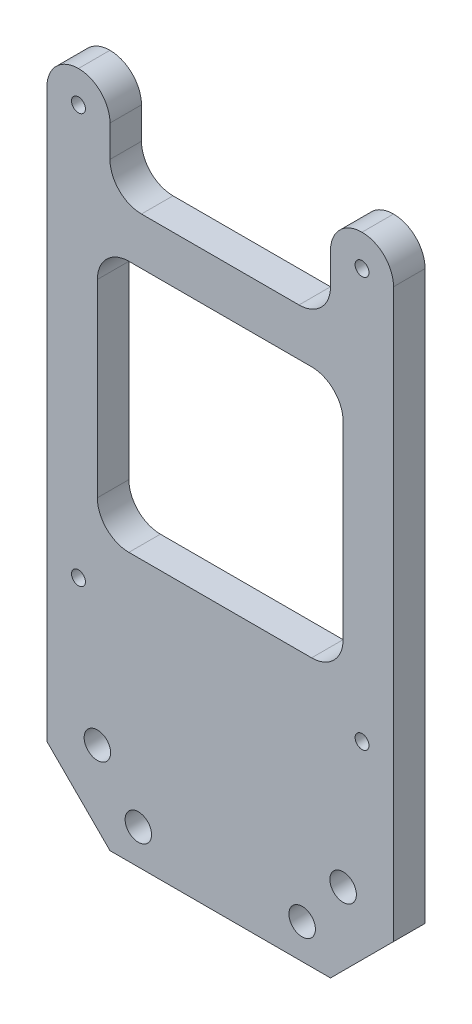
ISO-10303-21;
HEADER;
FILE_DESCRIPTION(('STEP AP214'),'2;1');
FILE_NAME('part.step','',(''),(''),'','','');
FILE_SCHEMA(('AUTOMOTIVE_DESIGN { 1 0 10303 214 1 1 1 1 }'));
ENDSEC;
DATA;
#1=APPLICATION_CONTEXT('core data for automotive mechanical design processes');
#2=APPLICATION_PROTOCOL_DEFINITION('international standard','automotive_design',2000,#1);
#3=PRODUCT_CONTEXT('',#1,'mechanical');
#4=PRODUCT('Part','Part','',(#3));
#5=PRODUCT_RELATED_PRODUCT_CATEGORY('part','',(#4));
#6=PRODUCT_DEFINITION_FORMATION('','',#4);
#7=PRODUCT_DEFINITION_CONTEXT('part definition',#1,'design');
#8=PRODUCT_DEFINITION('design','',#6,#7);
#9=PRODUCT_DEFINITION_SHAPE('','',#8);
#10=(LENGTH_UNIT() NAMED_UNIT(*) SI_UNIT(.MILLI.,.METRE.));
#11=(NAMED_UNIT(*) PLANE_ANGLE_UNIT() SI_UNIT($,.RADIAN.));
#12=(NAMED_UNIT(*) SI_UNIT($,.STERADIAN.) SOLID_ANGLE_UNIT());
#13=UNCERTAINTY_MEASURE_WITH_UNIT(LENGTH_MEASURE(1.E-05),#10,'distance_accuracy_value','');
#14=(GEOMETRIC_REPRESENTATION_CONTEXT(3) GLOBAL_UNCERTAINTY_ASSIGNED_CONTEXT((#13)) GLOBAL_UNIT_ASSIGNED_CONTEXT((#10,
#11,#12)) REPRESENTATION_CONTEXT('',''));
#15=CARTESIAN_POINT('',(0.,0.,0.));
#16=DIRECTION('',(0.,0.,1.));
#17=DIRECTION('',(1.,0.,0.));
#18=AXIS2_PLACEMENT_3D('',#15,#16,#17);
#19=CARTESIAN_POINT('',(0.,0.,5.));
#20=DIRECTION('',(0.,0.,1.));
#21=DIRECTION('',(1.,0.,0.));
#22=AXIS2_PLACEMENT_3D('',#19,#20,#21);
#23=PLANE('',#22);
#24=DIRECTION('',(0.,1.,0.));
#25=VECTOR('',#24,1.);
#26=CARTESIAN_POINT('',(19.5,30.,5.));
#27=LINE('',#26,#25);
#28=CARTESIAN_POINT('',(19.5,-5.,5.));
#29=VERTEX_POINT('',#28);
#30=CARTESIAN_POINT('',(19.5,25.,5.));
#31=VERTEX_POINT('',#30);
#32=EDGE_CURVE('E326',#29,#31,#27,.T.);
#33=ORIENTED_EDGE('',*,*,#32,.F.);
#34=CARTESIAN_POINT('',(14.5,-5.,5.));
#35=DIRECTION('',(0.,0.,1.));
#36=DIRECTION('',(1.,0.,0.));
#37=AXIS2_PLACEMENT_3D('',#34,#35,#36);
#38=CIRCLE('',#37,5.);
#39=CARTESIAN_POINT('',(14.5,-10.,5.));
#40=VERTEX_POINT('',#39);
#41=EDGE_CURVE('E274',#29,#40,#38,.F.);
#42=ORIENTED_EDGE('',*,*,#41,.T.);
#43=DIRECTION('',(1.,0.,0.));
#44=VECTOR('',#43,1.);
#45=CARTESIAN_POINT('',(-19.5,-10.,5.));
#46=LINE('',#45,#44);
#47=CARTESIAN_POINT('',(-14.5,-10.,5.));
#48=VERTEX_POINT('',#47);
#49=EDGE_CURVE('E351',#48,#40,#46,.T.);
#50=ORIENTED_EDGE('',*,*,#49,.F.);
#51=CARTESIAN_POINT('',(-14.5,-5.00000000000001,5.));
#52=DIRECTION('',(0.,0.,1.));
#53=DIRECTION('',(1.,0.,0.));
#54=AXIS2_PLACEMENT_3D('',#51,#52,#53);
#55=CIRCLE('',#54,5.);
#56=CARTESIAN_POINT('',(-19.5,-5.00000000000001,5.));
#57=VERTEX_POINT('',#56);
#58=EDGE_CURVE('E270',#48,#57,#55,.F.);
#59=ORIENTED_EDGE('',*,*,#58,.T.);
#60=DIRECTION('',(0.,-1.,0.));
#61=VECTOR('',#60,1.);
#62=CARTESIAN_POINT('',(-19.5,30.,5.));
#63=LINE('',#62,#61);
#64=CARTESIAN_POINT('',(-19.5,25.,5.));
#65=VERTEX_POINT('',#64);
#66=EDGE_CURVE('E357',#65,#57,#63,.T.);
#67=ORIENTED_EDGE('',*,*,#66,.F.);
#68=CARTESIAN_POINT('',(-14.5,25.,5.));
#69=DIRECTION('',(0.,0.,1.));
#70=DIRECTION('',(1.,0.,0.));
#71=AXIS2_PLACEMENT_3D('',#68,#69,#70);
#72=CIRCLE('',#71,5.);
#73=CARTESIAN_POINT('',(-14.5,30.,5.));
#74=VERTEX_POINT('',#73);
#75=EDGE_CURVE('E282',#65,#74,#72,.F.);
#76=ORIENTED_EDGE('',*,*,#75,.T.);
#77=DIRECTION('',(-1.,0.,0.));
#78=VECTOR('',#77,1.);
#79=CARTESIAN_POINT('',(-19.5,30.,5.));
#80=LINE('',#79,#78);
#81=CARTESIAN_POINT('',(14.5,30.,5.));
#82=VERTEX_POINT('',#81);
#83=EDGE_CURVE('E331',#82,#74,#80,.T.);
#84=ORIENTED_EDGE('',*,*,#83,.F.);
#85=CARTESIAN_POINT('',(14.5,25.,5.));
#86=DIRECTION('',(0.,0.,1.));
#87=DIRECTION('',(1.,0.,0.));
#88=AXIS2_PLACEMENT_3D('',#85,#86,#87);
#89=CIRCLE('',#88,5.);
#90=EDGE_CURVE('E278',#82,#31,#89,.F.);
#91=ORIENTED_EDGE('',*,*,#90,.T.);
#92=EDGE_LOOP('',(#33,#42,#50,#59,#67,#76,#84,#91));
#93=FACE_BOUND('',#92,.T.);
#94=CARTESIAN_POINT('',(22.5,47.5,5.));
#95=DIRECTION('',(0.,0.,1.));
#96=DIRECTION('',(1.,0.,0.));
#97=AXIS2_PLACEMENT_3D('',#94,#95,#96);
#98=CIRCLE('',#97,5.);
#99=CARTESIAN_POINT('',(27.5,47.5,5.));
#100=VERTEX_POINT('',#99);
#101=CARTESIAN_POINT('',(22.5,52.5,5.));
#102=VERTEX_POINT('',#101);
#103=EDGE_CURVE('E290',#100,#102,#98,.T.);
#104=ORIENTED_EDGE('',*,*,#103,.T.);
#105=CARTESIAN_POINT('',(22.5,47.5,5.));
#106=DIRECTION('',(0.,0.,1.));
#107=DIRECTION('',(1.,0.,0.));
#108=AXIS2_PLACEMENT_3D('',#105,#106,#107);
#109=CIRCLE('',#108,5.);
#110=CARTESIAN_POINT('',(17.5,47.5,5.));
#111=VERTEX_POINT('',#110);
#112=EDGE_CURVE('E292',#102,#111,#109,.T.);
#113=ORIENTED_EDGE('',*,*,#112,.T.);
#114=DIRECTION('',(0.,1.,0.));
#115=VECTOR('',#114,1.);
#116=CARTESIAN_POINT('',(17.5,52.5,5.));
#117=LINE('',#116,#115);
#118=CARTESIAN_POINT('',(17.5,42.5,5.));
#119=VERTEX_POINT('',#118);
#120=EDGE_CURVE('E354',#119,#111,#117,.T.);
#121=ORIENTED_EDGE('',*,*,#120,.F.);
#122=CARTESIAN_POINT('',(12.5,42.5,5.));
#123=DIRECTION('',(0.,0.,1.));
#124=DIRECTION('',(1.,0.,0.));
#125=AXIS2_PLACEMENT_3D('',#122,#123,#124);
#126=CIRCLE('',#125,5.);
#127=CARTESIAN_POINT('',(12.5,37.5,5.));
#128=VERTEX_POINT('',#127);
#129=EDGE_CURVE('E320',#119,#128,#126,.F.);
#130=ORIENTED_EDGE('',*,*,#129,.T.);
#131=DIRECTION('',(1.,0.,0.));
#132=VECTOR('',#131,1.);
#133=CARTESIAN_POINT('',(-17.5,37.5,5.));
#134=LINE('',#133,#132);
#135=CARTESIAN_POINT('',(-12.5,37.5,5.));
#136=VERTEX_POINT('',#135);
#137=EDGE_CURVE('E350',#136,#128,#134,.T.);
#138=ORIENTED_EDGE('',*,*,#137,.F.);
#139=CARTESIAN_POINT('',(-12.5,42.5,5.));
#140=DIRECTION('',(0.,0.,1.));
#141=DIRECTION('',(1.,0.,0.));
#142=AXIS2_PLACEMENT_3D('',#139,#140,#141);
#143=CIRCLE('',#142,5.);
#144=CARTESIAN_POINT('',(-17.5,42.5,5.));
#145=VERTEX_POINT('',#144);
#146=EDGE_CURVE('E47',#136,#145,#143,.F.);
#147=ORIENTED_EDGE('',*,*,#146,.T.);
#148=DIRECTION('',(0.,-1.,0.));
#149=VECTOR('',#148,1.);
#150=CARTESIAN_POINT('',(-17.5,52.5,5.));
#151=LINE('',#150,#149);
#152=CARTESIAN_POINT('',(-17.5,47.5,5.));
#153=VERTEX_POINT('',#152);
#154=EDGE_CURVE('E345',#153,#145,#151,.T.);
#155=ORIENTED_EDGE('',*,*,#154,.F.);
#156=CARTESIAN_POINT('',(-22.5,47.5,5.));
#157=DIRECTION('',(0.,0.,1.));
#158=DIRECTION('',(1.,0.,0.));
#159=AXIS2_PLACEMENT_3D('',#156,#157,#158);
#160=CIRCLE('',#159,5.);
#161=CARTESIAN_POINT('',(-22.5,52.5,5.));
#162=VERTEX_POINT('',#161);
#163=EDGE_CURVE('E286',#153,#162,#160,.T.);
#164=ORIENTED_EDGE('',*,*,#163,.T.);
#165=CARTESIAN_POINT('',(-22.5,47.5,5.));
#166=DIRECTION('',(0.,0.,1.));
#167=DIRECTION('',(1.,0.,0.));
#168=AXIS2_PLACEMENT_3D('',#165,#166,#167);
#169=CIRCLE('',#168,5.);
#170=CARTESIAN_POINT('',(-27.5,47.5,5.));
#171=VERTEX_POINT('',#170);
#172=EDGE_CURVE('E288',#162,#171,#169,.T.);
#173=ORIENTED_EDGE('',*,*,#172,.T.);
#174=DIRECTION('',(0.,-1.,0.));
#175=VECTOR('',#174,1.);
#176=CARTESIAN_POINT('',(-27.5,52.5,5.));
#177=LINE('',#176,#175);
#178=CARTESIAN_POINT('',(-27.5,-42.5,5.));
#179=VERTEX_POINT('',#178);
#180=EDGE_CURVE('E219',#171,#179,#177,.T.);
#181=ORIENTED_EDGE('',*,*,#180,.T.);
#182=DIRECTION('',(-0.707106781186547,0.707106781186549,0.));
#183=VECTOR('',#182,1.);
#184=CARTESIAN_POINT('',(-35.,-34.9999999999999,5.));
#185=LINE('',#184,#183);
#186=CARTESIAN_POINT('',(-17.5,-52.5,5.));
#187=VERTEX_POINT('',#186);
#188=EDGE_CURVE('E230',#179,#187,#185,.F.);
#189=ORIENTED_EDGE('',*,*,#188,.T.);
#190=DIRECTION('',(1.,0.,0.));
#191=VECTOR('',#190,1.);
#192=CARTESIAN_POINT('',(-27.5,-52.5,5.));
#193=LINE('',#192,#191);
#194=CARTESIAN_POINT('',(17.5,-52.5,5.));
#195=VERTEX_POINT('',#194);
#196=EDGE_CURVE('E208',#187,#195,#193,.T.);
#197=ORIENTED_EDGE('',*,*,#196,.T.);
#198=DIRECTION('',(-0.707106781186549,-0.707106781186547,0.));
#199=VECTOR('',#198,1.);
#200=CARTESIAN_POINT('',(35.,-35.0000000000001,5.));
#201=LINE('',#200,#199);
#202=CARTESIAN_POINT('',(27.5,-42.5,5.));
#203=VERTEX_POINT('',#202);
#204=EDGE_CURVE('E228',#195,#203,#201,.F.);
#205=ORIENTED_EDGE('',*,*,#204,.T.);
#206=DIRECTION('',(0.,1.,0.));
#207=VECTOR('',#206,1.);
#208=CARTESIAN_POINT('',(27.5,52.5,5.));
#209=LINE('',#208,#207);
#210=EDGE_CURVE('E215',#203,#100,#209,.T.);
#211=ORIENTED_EDGE('',*,*,#210,.T.);
#212=EDGE_LOOP('',(#104,#113,#121,#130,#138,#147,#155,#164,#173,#181,#189,#197,#205,#211));
#213=FACE_BOUND('',#212,.T.);
#214=CARTESIAN_POINT('',(-13.,-47.,5.));
#215=DIRECTION('',(0.,0.,1.));
#216=DIRECTION('',(1.,0.,0.));
#217=AXIS2_PLACEMENT_3D('',#214,#215,#216);
#218=CIRCLE('',#217,2.1);
#219=CARTESIAN_POINT('',(-10.9,-47.,5.));
#220=VERTEX_POINT('',#219);
#221=EDGE_CURVE('E387',#220,#220,#218,.T.);
#222=ORIENTED_EDGE('',*,*,#221,.F.);
#223=EDGE_LOOP('',(#222));
#224=FACE_BOUND('',#223,.T.);
#225=CARTESIAN_POINT('',(-19.5,-39.0000000000001,5.));
#226=DIRECTION('',(0.,0.,1.));
#227=DIRECTION('',(1.,0.,0.));
#228=AXIS2_PLACEMENT_3D('',#225,#226,#227);
#229=CIRCLE('',#228,2.1);
#230=CARTESIAN_POINT('',(-17.4,-39.0000000000001,5.));
#231=VERTEX_POINT('',#230);
#232=EDGE_CURVE('E384',#231,#231,#229,.T.);
#233=ORIENTED_EDGE('',*,*,#232,.F.);
#234=EDGE_LOOP('',(#233));
#235=FACE_BOUND('',#234,.T.);
#236=CARTESIAN_POINT('',(19.5,-39.,5.));
#237=DIRECTION('',(0.,0.,1.));
#238=DIRECTION('',(1.,0.,0.));
#239=AXIS2_PLACEMENT_3D('',#236,#237,#238);
#240=CIRCLE('',#239,2.1);
#241=CARTESIAN_POINT('',(21.6,-39.,5.));
#242=VERTEX_POINT('',#241);
#243=EDGE_CURVE('E381',#242,#242,#240,.T.);
#244=ORIENTED_EDGE('',*,*,#243,.F.);
#245=EDGE_LOOP('',(#244));
#246=FACE_BOUND('',#245,.T.);
#247=CARTESIAN_POINT('',(13.,-47.,5.));
#248=DIRECTION('',(0.,0.,1.));
#249=DIRECTION('',(1.,0.,0.));
#250=AXIS2_PLACEMENT_3D('',#247,#248,#249);
#251=CIRCLE('',#250,2.1);
#252=CARTESIAN_POINT('',(15.1,-47.,5.));
#253=VERTEX_POINT('',#252);
#254=EDGE_CURVE('E378',#253,#253,#251,.T.);
#255=ORIENTED_EDGE('',*,*,#254,.F.);
#256=EDGE_LOOP('',(#255));
#257=FACE_BOUND('',#256,.T.);
#258=CARTESIAN_POINT('',(-22.5,-17.5,5.));
#259=DIRECTION('',(0.,0.,1.));
#260=DIRECTION('',(1.,0.,0.));
#261=AXIS2_PLACEMENT_3D('',#258,#259,#260);
#262=CIRCLE('',#261,1.1);
#263=CARTESIAN_POINT('',(-21.4,-17.5,5.));
#264=VERTEX_POINT('',#263);
#265=EDGE_CURVE('E397',#264,#264,#262,.T.);
#266=ORIENTED_EDGE('',*,*,#265,.F.);
#267=EDGE_LOOP('',(#266));
#268=FACE_BOUND('',#267,.T.);
#269=CARTESIAN_POINT('',(-22.5,47.5,5.));
#270=DIRECTION('',(0.,0.,1.));
#271=DIRECTION('',(1.,0.,0.));
#272=AXIS2_PLACEMENT_3D('',#269,#270,#271);
#273=CIRCLE('',#272,1.1);
#274=CARTESIAN_POINT('',(-21.4,47.5,5.));
#275=VERTEX_POINT('',#274);
#276=EDGE_CURVE('E409',#275,#275,#273,.T.);
#277=ORIENTED_EDGE('',*,*,#276,.F.);
#278=EDGE_LOOP('',(#277));
#279=FACE_BOUND('',#278,.T.);
#280=CARTESIAN_POINT('',(22.5,47.5,5.));
#281=DIRECTION('',(0.,0.,1.));
#282=DIRECTION('',(-1.,0.,0.));
#283=AXIS2_PLACEMENT_3D('',#280,#281,#282);
#284=CIRCLE('',#283,1.1);
#285=CARTESIAN_POINT('',(21.4,47.5,5.));
#286=VERTEX_POINT('',#285);
#287=EDGE_CURVE('E403',#286,#286,#284,.T.);
#288=ORIENTED_EDGE('',*,*,#287,.F.);
#289=EDGE_LOOP('',(#288));
#290=FACE_BOUND('',#289,.T.);
#291=CARTESIAN_POINT('',(22.5,-17.5,5.));
#292=DIRECTION('',(0.,0.,1.));
#293=DIRECTION('',(-1.,0.,0.));
#294=AXIS2_PLACEMENT_3D('',#291,#292,#293);
#295=CIRCLE('',#294,1.1);
#296=CARTESIAN_POINT('',(21.4,-17.5,5.));
#297=VERTEX_POINT('',#296);
#298=EDGE_CURVE('E391',#297,#297,#295,.T.);
#299=ORIENTED_EDGE('',*,*,#298,.F.);
#300=EDGE_LOOP('',(#299));
#301=FACE_BOUND('',#300,.T.);
#302=ADVANCED_FACE('F38',(#93,#213,#224,#235,#246,#257,#268,#279,#290,#301),#23,.T.);
#303=CARTESIAN_POINT('',(0.,0.,0.));
#304=DIRECTION('',(0.,0.,1.));
#305=DIRECTION('',(1.,0.,0.));
#306=AXIS2_PLACEMENT_3D('',#303,#304,#305);
#307=PLANE('',#306);
#308=DIRECTION('',(0.,-1.,0.));
#309=VECTOR('',#308,1.);
#310=CARTESIAN_POINT('',(-19.5,0.,0.));
#311=LINE('',#310,#309);
#312=CARTESIAN_POINT('',(-19.5,25.,0.));
#313=VERTEX_POINT('',#312);
#314=CARTESIAN_POINT('',(-19.5,-5.00000000000001,0.));
#315=VERTEX_POINT('',#314);
#316=EDGE_CURVE('E241',#313,#315,#311,.T.);
#317=ORIENTED_EDGE('',*,*,#316,.T.);
#318=CARTESIAN_POINT('',(-14.5,-5.00000000000001,0.));
#319=DIRECTION('',(0.,0.,1.));
#320=DIRECTION('',(1.,0.,0.));
#321=AXIS2_PLACEMENT_3D('',#318,#319,#320);
#322=CIRCLE('',#321,5.);
#323=CARTESIAN_POINT('',(-14.5,-10.,0.));
#324=VERTEX_POINT('',#323);
#325=EDGE_CURVE('E272',#315,#324,#322,.T.);
#326=ORIENTED_EDGE('',*,*,#325,.T.);
#327=DIRECTION('',(1.,0.,0.));
#328=VECTOR('',#327,1.);
#329=CARTESIAN_POINT('',(0.,-10.,0.));
#330=LINE('',#329,#328);
#331=CARTESIAN_POINT('',(14.5,-10.,0.));
#332=VERTEX_POINT('',#331);
#333=EDGE_CURVE('E244',#324,#332,#330,.T.);
#334=ORIENTED_EDGE('',*,*,#333,.T.);
#335=CARTESIAN_POINT('',(14.5,-5.,0.));
#336=DIRECTION('',(0.,0.,1.));
#337=DIRECTION('',(1.,0.,0.));
#338=AXIS2_PLACEMENT_3D('',#335,#336,#337);
#339=CIRCLE('',#338,5.);
#340=CARTESIAN_POINT('',(19.5,-5.,0.));
#341=VERTEX_POINT('',#340);
#342=EDGE_CURVE('E276',#332,#341,#339,.T.);
#343=ORIENTED_EDGE('',*,*,#342,.T.);
#344=DIRECTION('',(0.,1.,0.));
#345=VECTOR('',#344,1.);
#346=CARTESIAN_POINT('',(19.5,0.,0.));
#347=LINE('',#346,#345);
#348=CARTESIAN_POINT('',(19.5,25.,0.));
#349=VERTEX_POINT('',#348);
#350=EDGE_CURVE('E247',#341,#349,#347,.T.);
#351=ORIENTED_EDGE('',*,*,#350,.T.);
#352=CARTESIAN_POINT('',(14.5,25.,0.));
#353=DIRECTION('',(0.,0.,1.));
#354=DIRECTION('',(1.,0.,0.));
#355=AXIS2_PLACEMENT_3D('',#352,#353,#354);
#356=CIRCLE('',#355,5.);
#357=CARTESIAN_POINT('',(14.5,30.,0.));
#358=VERTEX_POINT('',#357);
#359=EDGE_CURVE('E280',#349,#358,#356,.T.);
#360=ORIENTED_EDGE('',*,*,#359,.T.);
#361=DIRECTION('',(-1.,0.,0.));
#362=VECTOR('',#361,1.);
#363=CARTESIAN_POINT('',(0.,30.,0.));
#364=LINE('',#363,#362);
#365=CARTESIAN_POINT('',(-14.5,30.,0.));
#366=VERTEX_POINT('',#365);
#367=EDGE_CURVE('E238',#358,#366,#364,.T.);
#368=ORIENTED_EDGE('',*,*,#367,.T.);
#369=CARTESIAN_POINT('',(-14.5,25.,0.));
#370=DIRECTION('',(0.,0.,1.));
#371=DIRECTION('',(1.,0.,0.));
#372=AXIS2_PLACEMENT_3D('',#369,#370,#371);
#373=CIRCLE('',#372,5.);
#374=EDGE_CURVE('E284',#366,#313,#373,.T.);
#375=ORIENTED_EDGE('',*,*,#374,.T.);
#376=EDGE_LOOP('',(#317,#326,#334,#343,#351,#360,#368,#375));
#377=FACE_BOUND('',#376,.T.);
#378=CARTESIAN_POINT('',(-13.,-47.,0.));
#379=DIRECTION('',(0.,0.,-1.));
#380=DIRECTION('',(1.,0.,0.));
#381=AXIS2_PLACEMENT_3D('',#378,#379,#380);
#382=CIRCLE('',#381,2.1);
#383=CARTESIAN_POINT('',(-10.9,-47.,0.));
#384=VERTEX_POINT('',#383);
#385=EDGE_CURVE('E366',#384,#384,#382,.T.);
#386=ORIENTED_EDGE('',*,*,#385,.F.);
#387=EDGE_LOOP('',(#386));
#388=FACE_BOUND('',#387,.T.);
#389=CARTESIAN_POINT('',(-19.5,-39.0000000000001,0.));
#390=DIRECTION('',(0.,0.,-1.));
#391=DIRECTION('',(1.,0.,0.));
#392=AXIS2_PLACEMENT_3D('',#389,#390,#391);
#393=CIRCLE('',#392,2.1);
#394=CARTESIAN_POINT('',(-17.4,-39.0000000000001,0.));
#395=VERTEX_POINT('',#394);
#396=EDGE_CURVE('E371',#395,#395,#393,.T.);
#397=ORIENTED_EDGE('',*,*,#396,.F.);
#398=EDGE_LOOP('',(#397));
#399=FACE_BOUND('',#398,.T.);
#400=CARTESIAN_POINT('',(19.5,-39.,0.));
#401=DIRECTION('',(0.,0.,-1.));
#402=DIRECTION('',(-1.,0.,0.));
#403=AXIS2_PLACEMENT_3D('',#400,#401,#402);
#404=CIRCLE('',#403,2.1);
#405=CARTESIAN_POINT('',(17.4,-39.,0.));
#406=VERTEX_POINT('',#405);
#407=EDGE_CURVE('E367',#406,#406,#404,.T.);
#408=ORIENTED_EDGE('',*,*,#407,.F.);
#409=EDGE_LOOP('',(#408));
#410=FACE_BOUND('',#409,.T.);
#411=CARTESIAN_POINT('',(13.,-47.,0.));
#412=DIRECTION('',(0.,0.,-1.));
#413=DIRECTION('',(-1.,0.,0.));
#414=AXIS2_PLACEMENT_3D('',#411,#412,#413);
#415=CIRCLE('',#414,2.1);
#416=CARTESIAN_POINT('',(10.9,-47.,0.));
#417=VERTEX_POINT('',#416);
#418=EDGE_CURVE('E370',#417,#417,#415,.T.);
#419=ORIENTED_EDGE('',*,*,#418,.F.);
#420=EDGE_LOOP('',(#419));
#421=FACE_BOUND('',#420,.T.);
#422=DIRECTION('',(0.,1.,0.));
#423=VECTOR('',#422,1.);
#424=CARTESIAN_POINT('',(17.5,0.,0.));
#425=LINE('',#424,#423);
#426=CARTESIAN_POINT('',(17.5,42.5,0.));
#427=VERTEX_POINT('',#426);
#428=CARTESIAN_POINT('',(17.5,47.5,0.));
#429=VERTEX_POINT('',#428);
#430=EDGE_CURVE('E364',#427,#429,#425,.T.);
#431=ORIENTED_EDGE('',*,*,#430,.T.);
#432=CARTESIAN_POINT('',(22.5,47.5,0.));
#433=DIRECTION('',(0.,0.,1.));
#434=DIRECTION('',(1.,0.,0.));
#435=AXIS2_PLACEMENT_3D('',#432,#433,#434);
#436=CIRCLE('',#435,5.);
#437=CARTESIAN_POINT('',(22.5,52.5,0.));
#438=VERTEX_POINT('',#437);
#439=EDGE_CURVE('E305',#429,#438,#436,.F.);
#440=ORIENTED_EDGE('',*,*,#439,.T.);
#441=CARTESIAN_POINT('',(22.5,47.5,0.));
#442=DIRECTION('',(0.,0.,1.));
#443=DIRECTION('',(1.,0.,0.));
#444=AXIS2_PLACEMENT_3D('',#441,#442,#443);
#445=CIRCLE('',#444,5.);
#446=CARTESIAN_POINT('',(27.5,47.5,0.));
#447=VERTEX_POINT('',#446);
#448=EDGE_CURVE('E303',#438,#447,#445,.F.);
#449=ORIENTED_EDGE('',*,*,#448,.T.);
#450=DIRECTION('',(0.,1.,0.));
#451=VECTOR('',#450,1.);
#452=CARTESIAN_POINT('',(27.5,52.5,0.));
#453=LINE('',#452,#451);
#454=CARTESIAN_POINT('',(27.5,-42.5,0.));
#455=VERTEX_POINT('',#454);
#456=EDGE_CURVE('E221',#455,#447,#453,.T.);
#457=ORIENTED_EDGE('',*,*,#456,.F.);
#458=DIRECTION('',(0.707106781186549,0.707106781186547,0.));
#459=VECTOR('',#458,1.);
#460=CARTESIAN_POINT('',(27.5,-42.5,0.));
#461=LINE('',#460,#459);
#462=CARTESIAN_POINT('',(17.5,-52.5,0.));
#463=VERTEX_POINT('',#462);
#464=EDGE_CURVE('E199',#455,#463,#461,.F.);
#465=ORIENTED_EDGE('',*,*,#464,.T.);
#466=DIRECTION('',(1.,0.,0.));
#467=VECTOR('',#466,1.);
#468=CARTESIAN_POINT('',(-27.5,-52.5,0.));
#469=LINE('',#468,#467);
#470=CARTESIAN_POINT('',(-17.5,-52.5,0.));
#471=VERTEX_POINT('',#470);
#472=EDGE_CURVE('E205',#471,#463,#469,.T.);
#473=ORIENTED_EDGE('',*,*,#472,.F.);
#474=DIRECTION('',(0.707106781186547,-0.707106781186549,0.));
#475=VECTOR('',#474,1.);
#476=CARTESIAN_POINT('',(-17.5,-52.5,0.));
#477=LINE('',#476,#475);
#478=CARTESIAN_POINT('',(-27.5,-42.5,0.));
#479=VERTEX_POINT('',#478);
#480=EDGE_CURVE('E190',#471,#479,#477,.F.);
#481=ORIENTED_EDGE('',*,*,#480,.T.);
#482=DIRECTION('',(0.,-1.,0.));
#483=VECTOR('',#482,1.);
#484=CARTESIAN_POINT('',(-27.5,52.5,0.));
#485=LINE('',#484,#483);
#486=CARTESIAN_POINT('',(-27.5,47.5,0.));
#487=VERTEX_POINT('',#486);
#488=EDGE_CURVE('E216',#487,#479,#485,.T.);
#489=ORIENTED_EDGE('',*,*,#488,.F.);
#490=CARTESIAN_POINT('',(-22.5,47.5,0.));
#491=DIRECTION('',(0.,0.,1.));
#492=DIRECTION('',(1.,0.,0.));
#493=AXIS2_PLACEMENT_3D('',#490,#491,#492);
#494=CIRCLE('',#493,5.);
#495=CARTESIAN_POINT('',(-22.5,52.5,0.));
#496=VERTEX_POINT('',#495);
#497=EDGE_CURVE('E301',#487,#496,#494,.F.);
#498=ORIENTED_EDGE('',*,*,#497,.T.);
#499=CARTESIAN_POINT('',(-22.5,47.5,0.));
#500=DIRECTION('',(0.,0.,1.));
#501=DIRECTION('',(1.,0.,0.));
#502=AXIS2_PLACEMENT_3D('',#499,#500,#501);
#503=CIRCLE('',#502,5.);
#504=CARTESIAN_POINT('',(-17.5,47.5,0.));
#505=VERTEX_POINT('',#504);
#506=EDGE_CURVE('E62',#496,#505,#503,.F.);
#507=ORIENTED_EDGE('',*,*,#506,.T.);
#508=DIRECTION('',(0.,-1.,0.));
#509=VECTOR('',#508,1.);
#510=CARTESIAN_POINT('',(-17.5,0.,0.));
#511=LINE('',#510,#509);
#512=CARTESIAN_POINT('',(-17.5,42.5,0.));
#513=VERTEX_POINT('',#512);
#514=EDGE_CURVE('E346',#505,#513,#511,.T.);
#515=ORIENTED_EDGE('',*,*,#514,.T.);
#516=CARTESIAN_POINT('',(-12.5,42.5,0.));
#517=DIRECTION('',(0.,0.,1.));
#518=DIRECTION('',(1.,0.,0.));
#519=AXIS2_PLACEMENT_3D('',#516,#517,#518);
#520=CIRCLE('',#519,5.);
#521=CARTESIAN_POINT('',(-12.5,37.5,0.));
#522=VERTEX_POINT('',#521);
#523=EDGE_CURVE('E11',#513,#522,#520,.T.);
#524=ORIENTED_EDGE('',*,*,#523,.T.);
#525=DIRECTION('',(1.,0.,0.));
#526=VECTOR('',#525,1.);
#527=CARTESIAN_POINT('',(0.,37.5,0.));
#528=LINE('',#527,#526);
#529=CARTESIAN_POINT('',(12.5,37.5,0.));
#530=VERTEX_POINT('',#529);
#531=EDGE_CURVE('E235',#522,#530,#528,.T.);
#532=ORIENTED_EDGE('',*,*,#531,.T.);
#533=CARTESIAN_POINT('',(12.5,42.5,0.));
#534=DIRECTION('',(0.,0.,1.));
#535=DIRECTION('',(1.,0.,0.));
#536=AXIS2_PLACEMENT_3D('',#533,#534,#535);
#537=CIRCLE('',#536,5.);
#538=EDGE_CURVE('E322',#530,#427,#537,.T.);
#539=ORIENTED_EDGE('',*,*,#538,.T.);
#540=EDGE_LOOP('',(#431,#440,#449,#457,#465,#473,#481,#489,#498,#507,#515,#524,#532,#539));
#541=FACE_BOUND('',#540,.T.);
#542=CARTESIAN_POINT('',(-22.5,47.5,0.));
#543=DIRECTION('',(0.,0.,1.));
#544=DIRECTION('',(1.,0.,0.));
#545=AXIS2_PLACEMENT_3D('',#542,#543,#544);
#546=CIRCLE('',#545,1.1);
#547=CARTESIAN_POINT('',(-21.4,47.5,0.));
#548=VERTEX_POINT('',#547);
#549=EDGE_CURVE('E406',#548,#548,#546,.T.);
#550=ORIENTED_EDGE('',*,*,#549,.T.);
#551=EDGE_LOOP('',(#550));
#552=FACE_BOUND('',#551,.T.);
#553=CARTESIAN_POINT('',(22.5,47.5,0.));
#554=DIRECTION('',(0.,0.,1.));
#555=DIRECTION('',(-1.,0.,0.));
#556=AXIS2_PLACEMENT_3D('',#553,#554,#555);
#557=CIRCLE('',#556,1.1);
#558=CARTESIAN_POINT('',(21.4,47.5,0.));
#559=VERTEX_POINT('',#558);
#560=EDGE_CURVE('E400',#559,#559,#557,.T.);
#561=ORIENTED_EDGE('',*,*,#560,.T.);
#562=EDGE_LOOP('',(#561));
#563=FACE_BOUND('',#562,.T.);
#564=CARTESIAN_POINT('',(-22.5,-17.5,0.));
#565=DIRECTION('',(0.,0.,1.));
#566=DIRECTION('',(1.,0.,0.));
#567=AXIS2_PLACEMENT_3D('',#564,#565,#566);
#568=CIRCLE('',#567,1.1);
#569=CARTESIAN_POINT('',(-21.4,-17.5,0.));
#570=VERTEX_POINT('',#569);
#571=EDGE_CURVE('E394',#570,#570,#568,.T.);
#572=ORIENTED_EDGE('',*,*,#571,.T.);
#573=EDGE_LOOP('',(#572));
#574=FACE_BOUND('',#573,.T.);
#575=CARTESIAN_POINT('',(22.5,-17.5,0.));
#576=DIRECTION('',(0.,0.,1.));
#577=DIRECTION('',(-1.,0.,0.));
#578=AXIS2_PLACEMENT_3D('',#575,#576,#577);
#579=CIRCLE('',#578,1.1);
#580=CARTESIAN_POINT('',(21.4,-17.5,0.));
#581=VERTEX_POINT('',#580);
#582=EDGE_CURVE('E390',#581,#581,#579,.T.);
#583=ORIENTED_EDGE('',*,*,#582,.T.);
#584=EDGE_LOOP('',(#583));
#585=FACE_BOUND('',#584,.T.);
#586=ADVANCED_FACE('F212',(#377,#388,#399,#410,#421,#541,#552,#563,#574,#585),#307,.F.);
#587=CARTESIAN_POINT('',(27.5,52.5,5.));
#588=DIRECTION('',(-1.,0.,0.));
#589=DIRECTION('',(0.,-1.,0.));
#590=AXIS2_PLACEMENT_3D('',#587,#588,#589);
#591=PLANE('',#590);
#592=ORIENTED_EDGE('',*,*,#456,.T.);
#593=DIRECTION('',(0.,0.,-1.));
#594=VECTOR('',#593,1.);
#595=CARTESIAN_POINT('',(27.5,47.5,5.));
#596=LINE('',#595,#594);
#597=EDGE_CURVE('E307',#447,#100,#596,.F.);
#598=ORIENTED_EDGE('',*,*,#597,.T.);
#599=ORIENTED_EDGE('',*,*,#210,.F.);
#600=DIRECTION('',(0.,0.,-1.));
#601=VECTOR('',#600,1.);
#602=CARTESIAN_POINT('',(27.5,-42.5,5.));
#603=LINE('',#602,#601);
#604=EDGE_CURVE('E232',#203,#455,#603,.T.);
#605=ORIENTED_EDGE('',*,*,#604,.T.);
#606=EDGE_LOOP('',(#592,#598,#599,#605));
#607=FACE_BOUND('',#606,.T.);
#608=ADVANCED_FACE('F418',(#607),#591,.F.);
#609=CARTESIAN_POINT('',(-27.5,52.5,5.));
#610=DIRECTION('',(1.,0.,0.));
#611=DIRECTION('',(0.,1.,0.));
#612=AXIS2_PLACEMENT_3D('',#609,#610,#611);
#613=PLANE('',#612);
#614=ORIENTED_EDGE('',*,*,#180,.F.);
#615=DIRECTION('',(0.,0.,-1.));
#616=VECTOR('',#615,1.);
#617=CARTESIAN_POINT('',(-27.5,47.5,5.));
#618=LINE('',#617,#616);
#619=EDGE_CURVE('E309',#171,#487,#618,.T.);
#620=ORIENTED_EDGE('',*,*,#619,.T.);
#621=ORIENTED_EDGE('',*,*,#488,.T.);
#622=DIRECTION('',(0.,0.,1.));
#623=VECTOR('',#622,1.);
#624=CARTESIAN_POINT('',(-27.5,-42.5,5.));
#625=LINE('',#624,#623);
#626=EDGE_CURVE('E196',#479,#179,#625,.T.);
#627=ORIENTED_EDGE('',*,*,#626,.T.);
#628=EDGE_LOOP('',(#614,#620,#621,#627));
#629=FACE_BOUND('',#628,.T.);
#630=ADVANCED_FACE('F431',(#629),#613,.F.);
#631=CARTESIAN_POINT('',(-27.5,-52.5,5.));
#632=DIRECTION('',(0.,1.,0.));
#633=DIRECTION('',(0.,0.,1.));
#634=AXIS2_PLACEMENT_3D('',#631,#632,#633);
#635=PLANE('',#634);
#636=ORIENTED_EDGE('',*,*,#196,.F.);
#637=DIRECTION('',(0.,0.,-1.));
#638=VECTOR('',#637,1.);
#639=CARTESIAN_POINT('',(-17.5,-52.5,5.));
#640=LINE('',#639,#638);
#641=EDGE_CURVE('E194',#187,#471,#640,.T.);
#642=ORIENTED_EDGE('',*,*,#641,.T.);
#643=ORIENTED_EDGE('',*,*,#472,.T.);
#644=DIRECTION('',(0.,0.,1.));
#645=VECTOR('',#644,1.);
#646=CARTESIAN_POINT('',(17.5,-52.5,5.));
#647=LINE('',#646,#645);
#648=EDGE_CURVE('E209',#463,#195,#647,.T.);
#649=ORIENTED_EDGE('',*,*,#648,.T.);
#650=EDGE_LOOP('',(#636,#642,#643,#649));
#651=FACE_BOUND('',#650,.T.);
#652=ADVANCED_FACE('F204',(#651),#635,.F.);
#653=CARTESIAN_POINT('',(-22.5,47.5,5.));
#654=DIRECTION('',(0.,0.,-1.));
#655=DIRECTION('',(-1.,0.,0.));
#656=AXIS2_PLACEMENT_3D('',#653,#654,#655);
#657=CYLINDRICAL_SURFACE('',#656,1.1);
#658=ORIENTED_EDGE('',*,*,#276,.T.);
#659=EDGE_LOOP('',(#658));
#660=FACE_BOUND('',#659,.T.);
#661=ORIENTED_EDGE('',*,*,#549,.F.);
#662=EDGE_LOOP('',(#661));
#663=FACE_BOUND('',#662,.T.);
#664=ADVANCED_FACE('F438',(#660,#663),#657,.F.);
#665=CARTESIAN_POINT('',(22.5,47.5,5.));
#666=DIRECTION('',(0.,0.,-1.));
#667=DIRECTION('',(-1.,0.,0.));
#668=AXIS2_PLACEMENT_3D('',#665,#666,#667);
#669=CYLINDRICAL_SURFACE('',#668,1.1);
#670=ORIENTED_EDGE('',*,*,#287,.T.);
#671=EDGE_LOOP('',(#670));
#672=FACE_BOUND('',#671,.T.);
#673=ORIENTED_EDGE('',*,*,#560,.F.);
#674=EDGE_LOOP('',(#673));
#675=FACE_BOUND('',#674,.T.);
#676=ADVANCED_FACE('F453',(#672,#675),#669,.F.);
#677=CARTESIAN_POINT('',(-22.5,-17.5,5.));
#678=DIRECTION('',(0.,0.,-1.));
#679=DIRECTION('',(-1.,0.,0.));
#680=AXIS2_PLACEMENT_3D('',#677,#678,#679);
#681=CYLINDRICAL_SURFACE('',#680,1.1);
#682=ORIENTED_EDGE('',*,*,#265,.T.);
#683=EDGE_LOOP('',(#682));
#684=FACE_BOUND('',#683,.T.);
#685=ORIENTED_EDGE('',*,*,#571,.F.);
#686=EDGE_LOOP('',(#685));
#687=FACE_BOUND('',#686,.T.);
#688=ADVANCED_FACE('F457',(#684,#687),#681,.F.);
#689=CARTESIAN_POINT('',(22.5,-17.5,5.));
#690=DIRECTION('',(0.,0.,-1.));
#691=DIRECTION('',(-1.,0.,0.));
#692=AXIS2_PLACEMENT_3D('',#689,#690,#691);
#693=CYLINDRICAL_SURFACE('',#692,1.1);
#694=ORIENTED_EDGE('',*,*,#298,.T.);
#695=EDGE_LOOP('',(#694));
#696=FACE_BOUND('',#695,.T.);
#697=ORIENTED_EDGE('',*,*,#582,.F.);
#698=EDGE_LOOP('',(#697));
#699=FACE_BOUND('',#698,.T.);
#700=ADVANCED_FACE('F461',(#696,#699),#693,.F.);
#701=CARTESIAN_POINT('',(-17.5,-52.5,5.));
#702=DIRECTION('',(0.707106781186549,0.707106781186547,0.));
#703=DIRECTION('',(0.,0.,-1.));
#704=AXIS2_PLACEMENT_3D('',#701,#702,#703);
#705=PLANE('',#704);
#706=ORIENTED_EDGE('',*,*,#188,.F.);
#707=ORIENTED_EDGE('',*,*,#626,.F.);
#708=ORIENTED_EDGE('',*,*,#480,.F.);
#709=ORIENTED_EDGE('',*,*,#641,.F.);
#710=EDGE_LOOP('',(#706,#707,#708,#709));
#711=FACE_BOUND('',#710,.T.);
#712=ADVANCED_FACE('F193',(#711),#705,.F.);
#713=CARTESIAN_POINT('',(27.5,-42.5,5.));
#714=DIRECTION('',(-0.707106781186546,0.707106781186548,0.));
#715=DIRECTION('',(0.,0.,-1.));
#716=AXIS2_PLACEMENT_3D('',#713,#714,#715);
#717=PLANE('',#716);
#718=ORIENTED_EDGE('',*,*,#204,.F.);
#719=ORIENTED_EDGE('',*,*,#648,.F.);
#720=ORIENTED_EDGE('',*,*,#464,.F.);
#721=ORIENTED_EDGE('',*,*,#604,.F.);
#722=EDGE_LOOP('',(#718,#719,#720,#721));
#723=FACE_BOUND('',#722,.T.);
#724=ADVANCED_FACE('F428',(#723),#717,.F.);
#725=CARTESIAN_POINT('',(13.,-47.,10.));
#726=DIRECTION('',(0.,0.,-1.));
#727=DIRECTION('',(-1.,0.,0.));
#728=AXIS2_PLACEMENT_3D('',#725,#726,#727);
#729=CYLINDRICAL_SURFACE('',#728,2.1);
#730=ORIENTED_EDGE('',*,*,#254,.T.);
#731=EDGE_LOOP('',(#730));
#732=FACE_BOUND('',#731,.T.);
#733=ORIENTED_EDGE('',*,*,#418,.T.);
#734=EDGE_LOOP('',(#733));
#735=FACE_BOUND('',#734,.T.);
#736=ADVANCED_FACE('F466',(#732,#735),#729,.F.);
#737=CARTESIAN_POINT('',(19.5,-39.,10.));
#738=DIRECTION('',(0.,0.,-1.));
#739=DIRECTION('',(-1.,0.,0.));
#740=AXIS2_PLACEMENT_3D('',#737,#738,#739);
#741=CYLINDRICAL_SURFACE('',#740,2.1);
#742=ORIENTED_EDGE('',*,*,#243,.T.);
#743=EDGE_LOOP('',(#742));
#744=FACE_BOUND('',#743,.T.);
#745=ORIENTED_EDGE('',*,*,#407,.T.);
#746=EDGE_LOOP('',(#745));
#747=FACE_BOUND('',#746,.T.);
#748=ADVANCED_FACE('F469',(#744,#747),#741,.F.);
#749=CARTESIAN_POINT('',(-19.5,-39.0000000000001,10.));
#750=DIRECTION('',(0.,0.,-1.));
#751=DIRECTION('',(-1.,0.,0.));
#752=AXIS2_PLACEMENT_3D('',#749,#750,#751);
#753=CYLINDRICAL_SURFACE('',#752,2.1);
#754=ORIENTED_EDGE('',*,*,#232,.T.);
#755=EDGE_LOOP('',(#754));
#756=FACE_BOUND('',#755,.T.);
#757=ORIENTED_EDGE('',*,*,#396,.T.);
#758=EDGE_LOOP('',(#757));
#759=FACE_BOUND('',#758,.T.);
#760=ADVANCED_FACE('F475',(#756,#759),#753,.F.);
#761=CARTESIAN_POINT('',(-13.,-47.,10.));
#762=DIRECTION('',(0.,0.,-1.));
#763=DIRECTION('',(-1.,0.,0.));
#764=AXIS2_PLACEMENT_3D('',#761,#762,#763);
#765=CYLINDRICAL_SURFACE('',#764,2.1);
#766=ORIENTED_EDGE('',*,*,#221,.T.);
#767=EDGE_LOOP('',(#766));
#768=FACE_BOUND('',#767,.T.);
#769=ORIENTED_EDGE('',*,*,#385,.T.);
#770=EDGE_LOOP('',(#769));
#771=FACE_BOUND('',#770,.T.);
#772=ADVANCED_FACE('F471',(#768,#771),#765,.F.);
#773=CARTESIAN_POINT('',(-17.5,37.5,-5.));
#774=DIRECTION('',(0.,-1.,0.));
#775=DIRECTION('',(0.,0.,-1.));
#776=AXIS2_PLACEMENT_3D('',#773,#774,#775);
#777=PLANE('',#776);
#778=ORIENTED_EDGE('',*,*,#137,.T.);
#779=DIRECTION('',(0.,0.,1.));
#780=VECTOR('',#779,1.);
#781=CARTESIAN_POINT('',(12.5,37.5,0.));
#782=LINE('',#781,#780);
#783=EDGE_CURVE('E318',#128,#530,#782,.F.);
#784=ORIENTED_EDGE('',*,*,#783,.T.);
#785=ORIENTED_EDGE('',*,*,#531,.F.);
#786=DIRECTION('',(0.,0.,1.));
#787=VECTOR('',#786,1.);
#788=CARTESIAN_POINT('',(-12.5,37.5,5.));
#789=LINE('',#788,#787);
#790=EDGE_CURVE('E315',#522,#136,#789,.T.);
#791=ORIENTED_EDGE('',*,*,#790,.T.);
#792=EDGE_LOOP('',(#778,#784,#785,#791));
#793=FACE_BOUND('',#792,.T.);
#794=ADVANCED_FACE('F474',(#793),#777,.F.);
#795=CARTESIAN_POINT('',(17.5,52.5,-5.));
#796=DIRECTION('',(1.,0.,0.));
#797=DIRECTION('',(0.,0.,-1.));
#798=AXIS2_PLACEMENT_3D('',#795,#796,#797);
#799=PLANE('',#798);
#800=ORIENTED_EDGE('',*,*,#120,.T.);
#801=DIRECTION('',(0.,0.,1.));
#802=VECTOR('',#801,1.);
#803=CARTESIAN_POINT('',(17.5,47.5,-5.));
#804=LINE('',#803,#802);
#805=EDGE_CURVE('E297',#111,#429,#804,.F.);
#806=ORIENTED_EDGE('',*,*,#805,.T.);
#807=ORIENTED_EDGE('',*,*,#430,.F.);
#808=DIRECTION('',(0.,0.,1.));
#809=VECTOR('',#808,1.);
#810=CARTESIAN_POINT('',(17.5,42.5,5.));
#811=LINE('',#810,#809);
#812=EDGE_CURVE('E294',#427,#119,#811,.T.);
#813=ORIENTED_EDGE('',*,*,#812,.T.);
#814=EDGE_LOOP('',(#800,#806,#807,#813));
#815=FACE_BOUND('',#814,.T.);
#816=ADVANCED_FACE('F486',(#815),#799,.F.);
#817=CARTESIAN_POINT('',(-17.5,52.5,-5.));
#818=DIRECTION('',(-1.,0.,0.));
#819=DIRECTION('',(0.,0.,1.));
#820=AXIS2_PLACEMENT_3D('',#817,#818,#819);
#821=PLANE('',#820);
#822=ORIENTED_EDGE('',*,*,#514,.F.);
#823=DIRECTION('',(0.,0.,-1.));
#824=VECTOR('',#823,1.);
#825=CARTESIAN_POINT('',(-17.5,47.5,-5.));
#826=LINE('',#825,#824);
#827=EDGE_CURVE('E313',#505,#153,#826,.F.);
#828=ORIENTED_EDGE('',*,*,#827,.T.);
#829=ORIENTED_EDGE('',*,*,#154,.T.);
#830=DIRECTION('',(0.,0.,1.));
#831=VECTOR('',#830,1.);
#832=CARTESIAN_POINT('',(-17.5,42.5,0.));
#833=LINE('',#832,#831);
#834=EDGE_CURVE('E55',#145,#513,#833,.F.);
#835=ORIENTED_EDGE('',*,*,#834,.T.);
#836=EDGE_LOOP('',(#822,#828,#829,#835));
#837=FACE_BOUND('',#836,.T.);
#838=ADVANCED_FACE('F344',(#837),#821,.F.);
#839=CARTESIAN_POINT('',(19.5,30.,-5.));
#840=DIRECTION('',(1.,0.,0.));
#841=DIRECTION('',(0.,1.,0.));
#842=AXIS2_PLACEMENT_3D('',#839,#840,#841);
#843=PLANE('',#842);
#844=ORIENTED_EDGE('',*,*,#350,.F.);
#845=DIRECTION('',(0.,0.,1.));
#846=VECTOR('',#845,1.);
#847=CARTESIAN_POINT('',(19.5,-5.,5.));
#848=LINE('',#847,#846);
#849=EDGE_CURVE('E262',#341,#29,#848,.T.);
#850=ORIENTED_EDGE('',*,*,#849,.T.);
#851=ORIENTED_EDGE('',*,*,#32,.T.);
#852=DIRECTION('',(0.,0.,1.));
#853=VECTOR('',#852,1.);
#854=CARTESIAN_POINT('',(19.5,25.,0.));
#855=LINE('',#854,#853);
#856=EDGE_CURVE('E260',#31,#349,#855,.F.);
#857=ORIENTED_EDGE('',*,*,#856,.T.);
#858=EDGE_LOOP('',(#844,#850,#851,#857));
#859=FACE_BOUND('',#858,.T.);
#860=ADVANCED_FACE('F485',(#859),#843,.F.);
#861=CARTESIAN_POINT('',(-19.5,-10.,-5.));
#862=DIRECTION('',(0.,-1.,0.));
#863=DIRECTION('',(1.,0.,0.));
#864=AXIS2_PLACEMENT_3D('',#861,#862,#863);
#865=PLANE('',#864);
#866=ORIENTED_EDGE('',*,*,#333,.F.);
#867=DIRECTION('',(0.,0.,1.));
#868=VECTOR('',#867,1.);
#869=CARTESIAN_POINT('',(-14.5,-10.,5.));
#870=LINE('',#869,#868);
#871=EDGE_CURVE('E252',#324,#48,#870,.T.);
#872=ORIENTED_EDGE('',*,*,#871,.T.);
#873=ORIENTED_EDGE('',*,*,#49,.T.);
#874=DIRECTION('',(0.,0.,1.));
#875=VECTOR('',#874,1.);
#876=CARTESIAN_POINT('',(14.5,-10.,0.));
#877=LINE('',#876,#875);
#878=EDGE_CURVE('E250',#40,#332,#877,.F.);
#879=ORIENTED_EDGE('',*,*,#878,.T.);
#880=EDGE_LOOP('',(#866,#872,#873,#879));
#881=FACE_BOUND('',#880,.T.);
#882=ADVANCED_FACE('F495',(#881),#865,.F.);
#883=CARTESIAN_POINT('',(-19.5,30.,-5.));
#884=DIRECTION('',(-1.,0.,0.));
#885=DIRECTION('',(0.,-1.,0.));
#886=AXIS2_PLACEMENT_3D('',#883,#884,#885);
#887=PLANE('',#886);
#888=ORIENTED_EDGE('',*,*,#66,.T.);
#889=DIRECTION('',(0.,0.,1.));
#890=VECTOR('',#889,1.);
#891=CARTESIAN_POINT('',(-19.5,-5.00000000000001,0.));
#892=LINE('',#891,#890);
#893=EDGE_CURVE('E258',#57,#315,#892,.F.);
#894=ORIENTED_EDGE('',*,*,#893,.T.);
#895=ORIENTED_EDGE('',*,*,#316,.F.);
#896=DIRECTION('',(0.,0.,1.));
#897=VECTOR('',#896,1.);
#898=CARTESIAN_POINT('',(-19.5,25.,5.));
#899=LINE('',#898,#897);
#900=EDGE_CURVE('E255',#313,#65,#899,.T.);
#901=ORIENTED_EDGE('',*,*,#900,.T.);
#902=EDGE_LOOP('',(#888,#894,#895,#901));
#903=FACE_BOUND('',#902,.T.);
#904=ADVANCED_FACE('F501',(#903),#887,.F.);
#905=CARTESIAN_POINT('',(-19.5,30.,-5.));
#906=DIRECTION('',(0.,1.,0.));
#907=DIRECTION('',(-1.,0.,0.));
#908=AXIS2_PLACEMENT_3D('',#905,#906,#907);
#909=PLANE('',#908);
#910=ORIENTED_EDGE('',*,*,#367,.F.);
#911=DIRECTION('',(0.,0.,1.));
#912=VECTOR('',#911,1.);
#913=CARTESIAN_POINT('',(14.5,30.,5.));
#914=LINE('',#913,#912);
#915=EDGE_CURVE('E267',#358,#82,#914,.T.);
#916=ORIENTED_EDGE('',*,*,#915,.T.);
#917=ORIENTED_EDGE('',*,*,#83,.T.);
#918=DIRECTION('',(0.,0.,1.));
#919=VECTOR('',#918,1.);
#920=CARTESIAN_POINT('',(-14.5,30.,0.));
#921=LINE('',#920,#919);
#922=EDGE_CURVE('E265',#74,#366,#921,.F.);
#923=ORIENTED_EDGE('',*,*,#922,.T.);
#924=EDGE_LOOP('',(#910,#916,#917,#923));
#925=FACE_BOUND('',#924,.T.);
#926=ADVANCED_FACE('F497',(#925),#909,.F.);
#927=CARTESIAN_POINT('',(-14.5,-5.00000000000001,-5.));
#928=DIRECTION('',(0.,0.,-1.));
#929=DIRECTION('',(-1.,0.,0.));
#930=AXIS2_PLACEMENT_3D('',#927,#928,#929);
#931=CYLINDRICAL_SURFACE('',#930,5.);
#932=ORIENTED_EDGE('',*,*,#325,.F.);
#933=ORIENTED_EDGE('',*,*,#893,.F.);
#934=ORIENTED_EDGE('',*,*,#58,.F.);
#935=ORIENTED_EDGE('',*,*,#871,.F.);
#936=EDGE_LOOP('',(#932,#933,#934,#935));
#937=FACE_BOUND('',#936,.T.);
#938=ADVANCED_FACE('F500',(#937),#931,.F.);
#939=CARTESIAN_POINT('',(14.5,-5.,-5.));
#940=DIRECTION('',(0.,0.,-1.));
#941=DIRECTION('',(-1.,0.,0.));
#942=AXIS2_PLACEMENT_3D('',#939,#940,#941);
#943=CYLINDRICAL_SURFACE('',#942,5.);
#944=ORIENTED_EDGE('',*,*,#342,.F.);
#945=ORIENTED_EDGE('',*,*,#878,.F.);
#946=ORIENTED_EDGE('',*,*,#41,.F.);
#947=ORIENTED_EDGE('',*,*,#849,.F.);
#948=EDGE_LOOP('',(#944,#945,#946,#947));
#949=FACE_BOUND('',#948,.T.);
#950=ADVANCED_FACE('F539',(#949),#943,.F.);
#951=CARTESIAN_POINT('',(14.5,25.,-5.));
#952=DIRECTION('',(0.,0.,-1.));
#953=DIRECTION('',(-1.,0.,0.));
#954=AXIS2_PLACEMENT_3D('',#951,#952,#953);
#955=CYLINDRICAL_SURFACE('',#954,5.);
#956=ORIENTED_EDGE('',*,*,#359,.F.);
#957=ORIENTED_EDGE('',*,*,#856,.F.);
#958=ORIENTED_EDGE('',*,*,#90,.F.);
#959=ORIENTED_EDGE('',*,*,#915,.F.);
#960=EDGE_LOOP('',(#956,#957,#958,#959));
#961=FACE_BOUND('',#960,.T.);
#962=ADVANCED_FACE('F534',(#961),#955,.F.);
#963=CARTESIAN_POINT('',(-14.5,25.,-5.));
#964=DIRECTION('',(0.,0.,-1.));
#965=DIRECTION('',(-1.,0.,0.));
#966=AXIS2_PLACEMENT_3D('',#963,#964,#965);
#967=CYLINDRICAL_SURFACE('',#966,5.);
#968=ORIENTED_EDGE('',*,*,#374,.F.);
#969=ORIENTED_EDGE('',*,*,#922,.F.);
#970=ORIENTED_EDGE('',*,*,#75,.F.);
#971=ORIENTED_EDGE('',*,*,#900,.F.);
#972=EDGE_LOOP('',(#968,#969,#970,#971));
#973=FACE_BOUND('',#972,.T.);
#974=ADVANCED_FACE('F530',(#973),#967,.F.);
#975=CARTESIAN_POINT('',(22.5,47.5,5.));
#976=DIRECTION('',(0.,0.,-1.));
#977=DIRECTION('',(-1.,0.,0.));
#978=AXIS2_PLACEMENT_3D('',#975,#976,#977);
#979=CYLINDRICAL_SURFACE('',#978,5.);
#980=ORIENTED_EDGE('',*,*,#597,.F.);
#981=ORIENTED_EDGE('',*,*,#448,.F.);
#982=DIRECTION('',(0.,0.,-1.));
#983=VECTOR('',#982,1.);
#984=CARTESIAN_POINT('',(22.5,52.5,5.));
#985=LINE('',#984,#983);
#986=EDGE_CURVE('E324',#102,#438,#985,.T.);
#987=ORIENTED_EDGE('',*,*,#986,.F.);
#988=ORIENTED_EDGE('',*,*,#103,.F.);
#989=EDGE_LOOP('',(#980,#981,#987,#988));
#990=FACE_BOUND('',#989,.T.);
#991=ADVANCED_FACE('F424',(#990),#979,.T.);
#992=CARTESIAN_POINT('',(22.5,47.5,5.));
#993=DIRECTION('',(0.,0.,1.));
#994=DIRECTION('',(1.,0.,0.));
#995=AXIS2_PLACEMENT_3D('',#992,#993,#994);
#996=CYLINDRICAL_SURFACE('',#995,5.);
#997=ORIENTED_EDGE('',*,*,#439,.F.);
#998=ORIENTED_EDGE('',*,*,#805,.F.);
#999=ORIENTED_EDGE('',*,*,#112,.F.);
#1000=ORIENTED_EDGE('',*,*,#986,.T.);
#1001=EDGE_LOOP('',(#997,#998,#999,#1000));
#1002=FACE_BOUND('',#1001,.T.);
#1003=ADVANCED_FACE('F552',(#1002),#996,.T.);
#1004=CARTESIAN_POINT('',(-22.5,47.5,5.));
#1005=DIRECTION('',(0.,0.,-1.));
#1006=DIRECTION('',(-1.,0.,0.));
#1007=AXIS2_PLACEMENT_3D('',#1004,#1005,#1006);
#1008=CYLINDRICAL_SURFACE('',#1007,5.);
#1009=DIRECTION('',(0.,0.,-1.));
#1010=VECTOR('',#1009,1.);
#1011=CARTESIAN_POINT('',(-22.5,52.5,5.));
#1012=LINE('',#1011,#1010);
#1013=EDGE_CURVE('E42',#162,#496,#1012,.T.);
#1014=ORIENTED_EDGE('',*,*,#1013,.F.);
#1015=ORIENTED_EDGE('',*,*,#163,.F.);
#1016=ORIENTED_EDGE('',*,*,#827,.F.);
#1017=ORIENTED_EDGE('',*,*,#506,.F.);
#1018=EDGE_LOOP('',(#1014,#1015,#1016,#1017));
#1019=FACE_BOUND('',#1018,.T.);
#1020=ADVANCED_FACE('F341',(#1019),#1008,.T.);
#1021=CARTESIAN_POINT('',(-22.5,47.5,5.));
#1022=DIRECTION('',(0.,0.,-1.));
#1023=DIRECTION('',(-1.,0.,0.));
#1024=AXIS2_PLACEMENT_3D('',#1021,#1022,#1023);
#1025=CYLINDRICAL_SURFACE('',#1024,5.);
#1026=ORIENTED_EDGE('',*,*,#172,.F.);
#1027=ORIENTED_EDGE('',*,*,#1013,.T.);
#1028=ORIENTED_EDGE('',*,*,#497,.F.);
#1029=ORIENTED_EDGE('',*,*,#619,.F.);
#1030=EDGE_LOOP('',(#1026,#1027,#1028,#1029));
#1031=FACE_BOUND('',#1030,.T.);
#1032=ADVANCED_FACE('F337',(#1031),#1025,.T.);
#1033=CARTESIAN_POINT('',(12.5,42.5,-5.));
#1034=DIRECTION('',(0.,0.,-1.));
#1035=DIRECTION('',(-1.,0.,0.));
#1036=AXIS2_PLACEMENT_3D('',#1033,#1034,#1035);
#1037=CYLINDRICAL_SURFACE('',#1036,5.);
#1038=ORIENTED_EDGE('',*,*,#538,.F.);
#1039=ORIENTED_EDGE('',*,*,#783,.F.);
#1040=ORIENTED_EDGE('',*,*,#129,.F.);
#1041=ORIENTED_EDGE('',*,*,#812,.F.);
#1042=EDGE_LOOP('',(#1038,#1039,#1040,#1041));
#1043=FACE_BOUND('',#1042,.T.);
#1044=ADVANCED_FACE('F559',(#1043),#1037,.F.);
#1045=CARTESIAN_POINT('',(-12.5,42.5,-5.));
#1046=DIRECTION('',(0.,0.,-1.));
#1047=DIRECTION('',(-1.,0.,0.));
#1048=AXIS2_PLACEMENT_3D('',#1045,#1046,#1047);
#1049=CYLINDRICAL_SURFACE('',#1048,5.);
#1050=ORIENTED_EDGE('',*,*,#523,.F.);
#1051=ORIENTED_EDGE('',*,*,#834,.F.);
#1052=ORIENTED_EDGE('',*,*,#146,.F.);
#1053=ORIENTED_EDGE('',*,*,#790,.F.);
#1054=EDGE_LOOP('',(#1050,#1051,#1052,#1053));
#1055=FACE_BOUND('',#1054,.T.);
#1056=ADVANCED_FACE('F40',(#1055),#1049,.F.);
#1057=CLOSED_SHELL('',(#302,#586,#608,#630,#652,#664,#676,#688,#700,#712,#724,#736,#748,#760,
#772,#794,#816,#838,#860,#882,#904,#926,#938,#950,#962,#974,#991,#1003,#1020,#1032,#1044,#1056));
#1058=MANIFOLD_SOLID_BREP('B2',#1057);
#1059=ADVANCED_BREP_SHAPE_REPRESENTATION('',(#18,#1058),#14);
#1060=SHAPE_DEFINITION_REPRESENTATION(#9,#1059);
ENDSEC;
END-ISO-10303-21;
